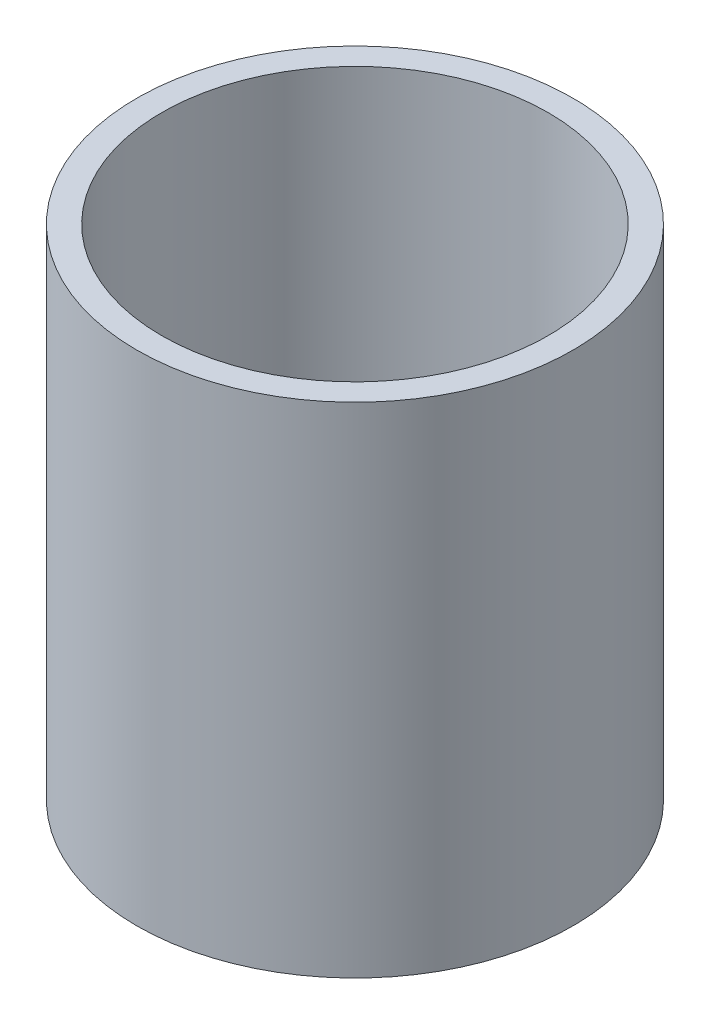
ISO-10303-21;
HEADER;
FILE_DESCRIPTION(('STEP AP214'),'2;1');
FILE_NAME('part.step','',(''),(''),'','','');
FILE_SCHEMA(('AUTOMOTIVE_DESIGN { 1 0 10303 214 1 1 1 1 }'));
ENDSEC;
DATA;
#1=APPLICATION_CONTEXT('core data for automotive mechanical design processes');
#2=APPLICATION_PROTOCOL_DEFINITION('international standard','automotive_design',2000,#1);
#3=PRODUCT_CONTEXT('',#1,'mechanical');
#4=PRODUCT('Part','Part','',(#3));
#5=PRODUCT_RELATED_PRODUCT_CATEGORY('part','',(#4));
#6=PRODUCT_DEFINITION_FORMATION('','',#4);
#7=PRODUCT_DEFINITION_CONTEXT('part definition',#1,'design');
#8=PRODUCT_DEFINITION('design','',#6,#7);
#9=PRODUCT_DEFINITION_SHAPE('','',#8);
#10=(LENGTH_UNIT() NAMED_UNIT(*) SI_UNIT(.MILLI.,.METRE.));
#11=(NAMED_UNIT(*) PLANE_ANGLE_UNIT() SI_UNIT($,.RADIAN.));
#12=(NAMED_UNIT(*) SI_UNIT($,.STERADIAN.) SOLID_ANGLE_UNIT());
#13=UNCERTAINTY_MEASURE_WITH_UNIT(LENGTH_MEASURE(1.E-05),#10,'distance_accuracy_value','');
#14=(GEOMETRIC_REPRESENTATION_CONTEXT(3) GLOBAL_UNCERTAINTY_ASSIGNED_CONTEXT((#13)) GLOBAL_UNIT_ASSIGNED_CONTEXT((#10,
#11,#12)) REPRESENTATION_CONTEXT('',''));
#15=CARTESIAN_POINT('',(0.,0.,0.));
#16=DIRECTION('',(0.,0.,1.));
#17=DIRECTION('',(1.,0.,0.));
#18=AXIS2_PLACEMENT_3D('',#15,#16,#17);
#19=CARTESIAN_POINT('',(0.,127.,0.));
#20=DIRECTION('',(0.,-1.,0.));
#21=DIRECTION('',(0.,0.,-1.));
#22=AXIS2_PLACEMENT_3D('',#19,#20,#21);
#23=CYLINDRICAL_SURFACE('',#22,49.2125);
#24=CARTESIAN_POINT('',(0.,127.,0.));
#25=DIRECTION('',(0.,1.,0.));
#26=DIRECTION('',(0.,0.,1.));
#27=AXIS2_PLACEMENT_3D('',#24,#25,#26);
#28=CIRCLE('',#27,49.2125);
#29=CARTESIAN_POINT('',(0.,127.,49.2125));
#30=VERTEX_POINT('',#29);
#31=EDGE_CURVE('E47',#30,#30,#28,.T.);
#32=ORIENTED_EDGE('',*,*,#31,.T.);
#33=EDGE_LOOP('',(#32));
#34=FACE_BOUND('',#33,.T.);
#35=CARTESIAN_POINT('',(0.,0.,0.));
#36=DIRECTION('',(0.,1.,0.));
#37=DIRECTION('',(0.,0.,1.));
#38=AXIS2_PLACEMENT_3D('',#35,#36,#37);
#39=CIRCLE('',#38,49.2125);
#40=CARTESIAN_POINT('',(0.,0.,49.2125));
#41=VERTEX_POINT('',#40);
#42=EDGE_CURVE('E54',#41,#41,#39,.T.);
#43=ORIENTED_EDGE('',*,*,#42,.F.);
#44=EDGE_LOOP('',(#43));
#45=FACE_BOUND('',#44,.T.);
#46=ADVANCED_FACE('F39',(#34,#45),#23,.F.);
#47=CARTESIAN_POINT('',(0.,127.,0.));
#48=DIRECTION('',(0.,-1.,0.));
#49=DIRECTION('',(0.,0.,-1.));
#50=AXIS2_PLACEMENT_3D('',#47,#48,#49);
#51=CYLINDRICAL_SURFACE('',#50,55.5625);
#52=CARTESIAN_POINT('',(0.,127.,0.));
#53=DIRECTION('',(0.,1.,0.));
#54=DIRECTION('',(0.,0.,1.));
#55=AXIS2_PLACEMENT_3D('',#52,#53,#54);
#56=CIRCLE('',#55,55.5625);
#57=CARTESIAN_POINT('',(0.,127.,55.5625));
#58=VERTEX_POINT('',#57);
#59=EDGE_CURVE('E10',#58,#58,#56,.T.);
#60=ORIENTED_EDGE('',*,*,#59,.F.);
#61=EDGE_LOOP('',(#60));
#62=FACE_BOUND('',#61,.T.);
#63=CARTESIAN_POINT('',(0.,0.,0.));
#64=DIRECTION('',(0.,1.,0.));
#65=DIRECTION('',(0.,0.,1.));
#66=AXIS2_PLACEMENT_3D('',#63,#64,#65);
#67=CIRCLE('',#66,55.5625);
#68=CARTESIAN_POINT('',(0.,0.,55.5625));
#69=VERTEX_POINT('',#68);
#70=EDGE_CURVE('E42',#69,#69,#67,.T.);
#71=ORIENTED_EDGE('',*,*,#70,.T.);
#72=EDGE_LOOP('',(#71));
#73=FACE_BOUND('',#72,.T.);
#74=ADVANCED_FACE('F63',(#62,#73),#51,.T.);
#75=CARTESIAN_POINT('',(0.,127.,0.));
#76=DIRECTION('',(0.,1.,0.));
#77=DIRECTION('',(0.,0.,1.));
#78=AXIS2_PLACEMENT_3D('',#75,#76,#77);
#79=PLANE('',#78);
#80=ORIENTED_EDGE('',*,*,#31,.F.);
#81=EDGE_LOOP('',(#80));
#82=FACE_BOUND('',#81,.T.);
#83=ORIENTED_EDGE('',*,*,#59,.T.);
#84=EDGE_LOOP('',(#83));
#85=FACE_BOUND('',#84,.T.);
#86=ADVANCED_FACE('F67',(#82,#85),#79,.T.);
#87=CARTESIAN_POINT('',(0.,0.,0.));
#88=DIRECTION('',(0.,1.,0.));
#89=DIRECTION('',(0.,0.,1.));
#90=AXIS2_PLACEMENT_3D('',#87,#88,#89);
#91=PLANE('',#90);
#92=ORIENTED_EDGE('',*,*,#42,.T.);
#93=EDGE_LOOP('',(#92));
#94=FACE_BOUND('',#93,.T.);
#95=ORIENTED_EDGE('',*,*,#70,.F.);
#96=EDGE_LOOP('',(#95));
#97=FACE_BOUND('',#96,.T.);
#98=ADVANCED_FACE('F65',(#94,#97),#91,.F.);
#99=CLOSED_SHELL('',(#46,#74,#86,#98));
#100=MANIFOLD_SOLID_BREP('B2',#99);
#101=ADVANCED_BREP_SHAPE_REPRESENTATION('',(#18,#100),#14);
#102=SHAPE_DEFINITION_REPRESENTATION(#9,#101);
ENDSEC;
END-ISO-10303-21;
